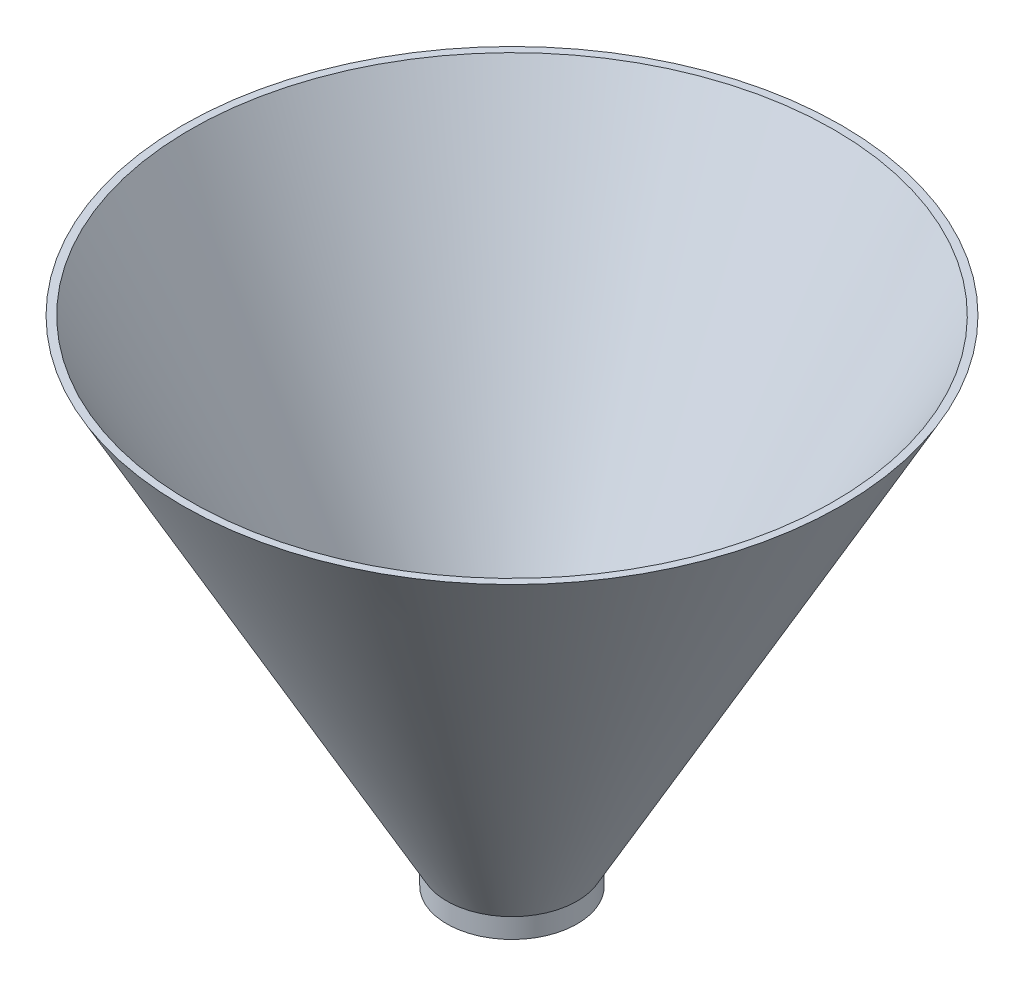
ISO-10303-21;
HEADER;
FILE_DESCRIPTION(('STEP AP214'),'2;1');
FILE_NAME('part.step','',(''),(''),'','','');
FILE_SCHEMA(('AUTOMOTIVE_DESIGN { 1 0 10303 214 1 1 1 1 }'));
ENDSEC;
DATA;
#1=APPLICATION_CONTEXT('core data for automotive mechanical design processes');
#2=APPLICATION_PROTOCOL_DEFINITION('international standard','automotive_design',2000,#1);
#3=PRODUCT_CONTEXT('',#1,'mechanical');
#4=PRODUCT('Part','Part','',(#3));
#5=PRODUCT_RELATED_PRODUCT_CATEGORY('part','',(#4));
#6=PRODUCT_DEFINITION_FORMATION('','',#4);
#7=PRODUCT_DEFINITION_CONTEXT('part definition',#1,'design');
#8=PRODUCT_DEFINITION('design','',#6,#7);
#9=PRODUCT_DEFINITION_SHAPE('','',#8);
#10=(LENGTH_UNIT() NAMED_UNIT(*) SI_UNIT(.MILLI.,.METRE.));
#11=(NAMED_UNIT(*) PLANE_ANGLE_UNIT() SI_UNIT($,.RADIAN.));
#12=(NAMED_UNIT(*) SI_UNIT($,.STERADIAN.) SOLID_ANGLE_UNIT());
#13=UNCERTAINTY_MEASURE_WITH_UNIT(LENGTH_MEASURE(1.E-05),#10,'distance_accuracy_value','');
#14=(GEOMETRIC_REPRESENTATION_CONTEXT(3) GLOBAL_UNCERTAINTY_ASSIGNED_CONTEXT((#13)) GLOBAL_UNIT_ASSIGNED_CONTEXT((#10,
#11,#12)) REPRESENTATION_CONTEXT('',''));
#15=CARTESIAN_POINT('',(0.,0.,0.));
#16=DIRECTION('',(0.,0.,1.));
#17=DIRECTION('',(1.,0.,0.));
#18=AXIS2_PLACEMENT_3D('',#15,#16,#17);
#19=CARTESIAN_POINT('',(0.,3.,0.));
#20=DIRECTION('',(0.,1.,0.));
#21=DIRECTION('',(0.,0.,1.));
#22=AXIS2_PLACEMENT_3D('',#19,#20,#21);
#23=CONICAL_SURFACE('',#22,9.9,0.508159199339276);
#24=CARTESIAN_POINT('',(0.,75.,0.));
#25=DIRECTION('',(0.,-1.,0.));
#26=DIRECTION('',(0.,0.,-1.));
#27=AXIS2_PLACEMENT_3D('',#24,#25,#26);
#28=CIRCLE('',#27,50.);
#29=CARTESIAN_POINT('',(0.,75.,-50.));
#30=VERTEX_POINT('',#29);
#31=EDGE_CURVE('E66',#30,#30,#28,.T.);
#32=ORIENTED_EDGE('',*,*,#31,.T.);
#33=EDGE_LOOP('',(#32));
#34=FACE_BOUND('',#33,.T.);
#35=CARTESIAN_POINT('',(0.,3.,0.));
#36=DIRECTION('',(0.,-1.,0.));
#37=DIRECTION('',(0.,0.,-1.));
#38=AXIS2_PLACEMENT_3D('',#35,#36,#37);
#39=CIRCLE('',#38,9.9);
#40=CARTESIAN_POINT('',(0.,3.,-9.9));
#41=VERTEX_POINT('',#40);
#42=EDGE_CURVE('E10',#41,#41,#39,.T.);
#43=ORIENTED_EDGE('',*,*,#42,.F.);
#44=EDGE_LOOP('',(#43));
#45=FACE_BOUND('',#44,.T.);
#46=ADVANCED_FACE('F43',(#34,#45),#23,.T.);
#47=CARTESIAN_POINT('',(0.,0.,0.));
#48=DIRECTION('',(0.,-1.,0.));
#49=DIRECTION('',(0.,0.,-1.));
#50=AXIS2_PLACEMENT_3D('',#47,#48,#49);
#51=CYLINDRICAL_SURFACE('',#50,9.9);
#52=ORIENTED_EDGE('',*,*,#42,.T.);
#53=EDGE_LOOP('',(#52));
#54=FACE_BOUND('',#53,.T.);
#55=CARTESIAN_POINT('',(0.,0.,0.));
#56=DIRECTION('',(0.,-1.,0.));
#57=DIRECTION('',(0.,0.,-1.));
#58=AXIS2_PLACEMENT_3D('',#55,#56,#57);
#59=CIRCLE('',#58,9.9);
#60=CARTESIAN_POINT('',(0.,0.,-9.9));
#61=VERTEX_POINT('',#60);
#62=EDGE_CURVE('E50',#61,#61,#59,.T.);
#63=ORIENTED_EDGE('',*,*,#62,.F.);
#64=EDGE_LOOP('',(#63));
#65=FACE_BOUND('',#64,.T.);
#66=ADVANCED_FACE('F89',(#54,#65),#51,.T.);
#67=CARTESIAN_POINT('',(0.,0.,-9.9));
#68=DIRECTION('',(0.,1.,0.));
#69=DIRECTION('',(0.,0.,1.));
#70=AXIS2_PLACEMENT_3D('',#67,#68,#69);
#71=PLANE('',#70);
#72=CARTESIAN_POINT('',(0.,0.,0.));
#73=DIRECTION('',(0.,-1.,0.));
#74=DIRECTION('',(0.,0.,-1.));
#75=AXIS2_PLACEMENT_3D('',#72,#73,#74);
#76=CIRCLE('',#75,8.9);
#77=CARTESIAN_POINT('',(0.,0.,-8.9));
#78=VERTEX_POINT('',#77);
#79=EDGE_CURVE('E55',#78,#78,#76,.T.);
#80=ORIENTED_EDGE('',*,*,#79,.F.);
#81=EDGE_LOOP('',(#80));
#82=FACE_BOUND('',#81,.T.);
#83=ORIENTED_EDGE('',*,*,#62,.T.);
#84=EDGE_LOOP('',(#83));
#85=FACE_BOUND('',#84,.T.);
#86=ADVANCED_FACE('F95',(#82,#85),#71,.F.);
#87=CARTESIAN_POINT('',(0.,0.,0.));
#88=DIRECTION('',(0.,-1.,0.));
#89=DIRECTION('',(0.,0.,-1.));
#90=AXIS2_PLACEMENT_3D('',#87,#88,#89);
#91=CYLINDRICAL_SURFACE('',#90,8.9);
#92=CARTESIAN_POINT('',(0.,3.25969206438226,0.));
#93=DIRECTION('',(0.,-1.,0.));
#94=DIRECTION('',(0.,0.,-1.));
#95=AXIS2_PLACEMENT_3D('',#92,#93,#94);
#96=CIRCLE('',#95,8.9);
#97=CARTESIAN_POINT('',(0.,3.25969206438226,-8.9));
#98=VERTEX_POINT('',#97);
#99=EDGE_CURVE('E60',#98,#98,#96,.T.);
#100=ORIENTED_EDGE('',*,*,#99,.F.);
#101=EDGE_LOOP('',(#100));
#102=FACE_BOUND('',#101,.T.);
#103=ORIENTED_EDGE('',*,*,#79,.T.);
#104=EDGE_LOOP('',(#103));
#105=FACE_BOUND('',#104,.T.);
#106=ADVANCED_FACE('F85',(#102,#105),#91,.F.);
#107=CARTESIAN_POINT('',(0.,3.25969206438226,0.));
#108=DIRECTION('',(0.,1.,0.));
#109=DIRECTION('',(0.,0.,1.));
#110=AXIS2_PLACEMENT_3D('',#107,#108,#109);
#111=CONICAL_SURFACE('',#110,8.9,0.508159199339276);
#112=CARTESIAN_POINT('',(0.,75.,0.));
#113=DIRECTION('',(0.,-1.,0.));
#114=DIRECTION('',(0.,0.,-1.));
#115=AXIS2_PLACEMENT_3D('',#112,#113,#114);
#116=CIRCLE('',#115,48.855365947476);
#117=CARTESIAN_POINT('',(0.,75.,-48.855365947476));
#118=VERTEX_POINT('',#117);
#119=EDGE_CURVE('E70',#118,#118,#116,.F.);
#120=ORIENTED_EDGE('',*,*,#119,.T.);
#121=EDGE_LOOP('',(#120));
#122=FACE_BOUND('',#121,.T.);
#123=ORIENTED_EDGE('',*,*,#99,.T.);
#124=EDGE_LOOP('',(#123));
#125=FACE_BOUND('',#124,.T.);
#126=ADVANCED_FACE('F75',(#122,#125),#111,.F.);
#127=CARTESIAN_POINT('',(-50.,75.,50.));
#128=DIRECTION('',(0.,-1.,0.));
#129=DIRECTION('',(0.,0.,-1.));
#130=AXIS2_PLACEMENT_3D('',#127,#128,#129);
#131=PLANE('',#130);
#132=ORIENTED_EDGE('',*,*,#31,.F.);
#133=EDGE_LOOP('',(#132));
#134=FACE_BOUND('',#133,.T.);
#135=ORIENTED_EDGE('',*,*,#119,.F.);
#136=EDGE_LOOP('',(#135));
#137=FACE_BOUND('',#136,.T.);
#138=ADVANCED_FACE('F78',(#134,#137),#131,.F.);
#139=CLOSED_SHELL('',(#46,#66,#86,#106,#126,#138));
#140=MANIFOLD_SOLID_BREP('B2',#139);
#141=ADVANCED_BREP_SHAPE_REPRESENTATION('',(#18,#140),#14);
#142=SHAPE_DEFINITION_REPRESENTATION(#9,#141);
ENDSEC;
END-ISO-10303-21;
